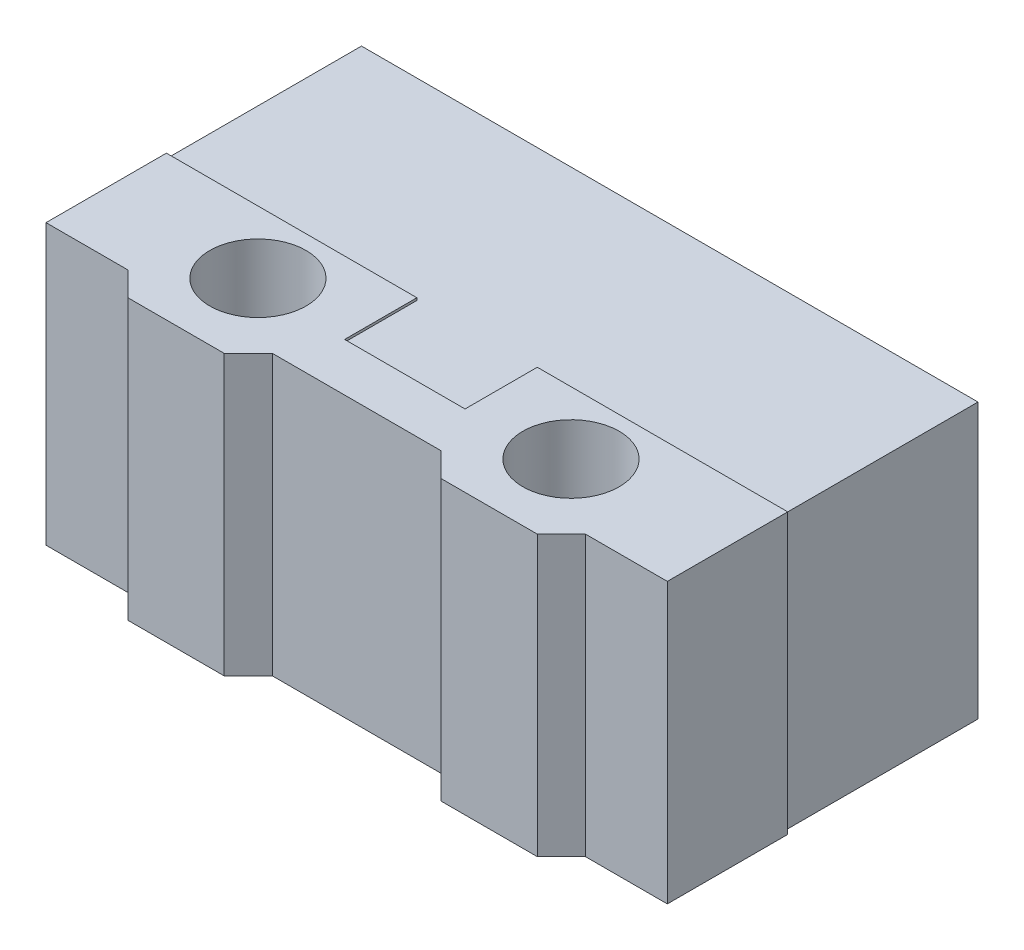
ISO-10303-21;
HEADER;
FILE_DESCRIPTION(('STEP AP214'),'2;1');
FILE_NAME('part.step','',(''),(''),'','','');
FILE_SCHEMA(('AUTOMOTIVE_DESIGN { 1 0 10303 214 1 1 1 1 }'));
ENDSEC;
DATA;
#1=APPLICATION_CONTEXT('core data for automotive mechanical design processes');
#2=APPLICATION_PROTOCOL_DEFINITION('international standard','automotive_design',2000,#1);
#3=PRODUCT_CONTEXT('',#1,'mechanical');
#4=PRODUCT('Part','Part','',(#3));
#5=PRODUCT_RELATED_PRODUCT_CATEGORY('part','',(#4));
#6=PRODUCT_DEFINITION_FORMATION('','',#4);
#7=PRODUCT_DEFINITION_CONTEXT('part definition',#1,'design');
#8=PRODUCT_DEFINITION('design','',#6,#7);
#9=PRODUCT_DEFINITION_SHAPE('','',#8);
#10=(LENGTH_UNIT() NAMED_UNIT(*) SI_UNIT(.MILLI.,.METRE.));
#11=(NAMED_UNIT(*) PLANE_ANGLE_UNIT() SI_UNIT($,.RADIAN.));
#12=(NAMED_UNIT(*) SI_UNIT($,.STERADIAN.) SOLID_ANGLE_UNIT());
#13=UNCERTAINTY_MEASURE_WITH_UNIT(LENGTH_MEASURE(1.E-05),#10,'distance_accuracy_value','');
#14=(GEOMETRIC_REPRESENTATION_CONTEXT(3) GLOBAL_UNCERTAINTY_ASSIGNED_CONTEXT((#13)) GLOBAL_UNIT_ASSIGNED_CONTEXT((#10,
#11,#12)) REPRESENTATION_CONTEXT('',''));
#15=CARTESIAN_POINT('',(0.,0.,0.));
#16=DIRECTION('',(0.,0.,1.));
#17=DIRECTION('',(1.,0.,0.));
#18=AXIS2_PLACEMENT_3D('',#15,#16,#17);
#19=CARTESIAN_POINT('',(0.,-2.9,0.));
#20=DIRECTION('',(0.,1.,0.));
#21=DIRECTION('',(0.,0.,1.));
#22=AXIS2_PLACEMENT_3D('',#19,#20,#21);
#23=PLANE('',#22);
#24=CARTESIAN_POINT('',(-3.25,-2.9,2.05));
#25=DIRECTION('',(0.,-1.,0.));
#26=DIRECTION('',(0.,0.,-1.));
#27=AXIS2_PLACEMENT_3D('',#24,#25,#26);
#28=CIRCLE('',#27,0.999999999999987);
#29=CARTESIAN_POINT('',(-3.25,-2.9,1.05000000000001));
#30=VERTEX_POINT('',#29);
#31=EDGE_CURVE('E789',#30,#30,#28,.T.);
#32=ORIENTED_EDGE('',*,*,#31,.F.);
#33=EDGE_LOOP('',(#32));
#34=FACE_BOUND('',#33,.T.);
#35=DIRECTION('',(-1.,0.,0.));
#36=VECTOR('',#35,1.);
#37=CARTESIAN_POINT('',(-1.69135538907714E-13,-2.9,3.24999999999967));
#38=LINE('',#37,#36);
#39=CARTESIAN_POINT('',(6.45,-2.9,3.25));
#40=VERTEX_POINT('',#39);
#41=CARTESIAN_POINT('',(4.75,-2.9,3.25));
#42=VERTEX_POINT('',#41);
#43=EDGE_CURVE('E329',#40,#42,#38,.T.);
#44=ORIENTED_EDGE('',*,*,#43,.T.);
#45=DIRECTION('',(0.707106781186548,0.,-0.707106781186547));
#46=VECTOR('',#45,1.);
#47=CARTESIAN_POINT('',(4.,-2.9,4.));
#48=LINE('',#47,#46);
#49=CARTESIAN_POINT('',(4.25,-2.9,3.75));
#50=VERTEX_POINT('',#49);
#51=EDGE_CURVE('E357',#50,#42,#48,.T.);
#52=ORIENTED_EDGE('',*,*,#51,.F.);
#53=DIRECTION('',(1.,0.,0.));
#54=VECTOR('',#53,1.);
#55=CARTESIAN_POINT('',(0.,-2.9,3.75));
#56=LINE('',#55,#54);
#57=CARTESIAN_POINT('',(2.25,-2.9,3.75));
#58=VERTEX_POINT('',#57);
#59=EDGE_CURVE('E355',#58,#50,#56,.T.);
#60=ORIENTED_EDGE('',*,*,#59,.F.);
#61=DIRECTION('',(0.707106781186548,0.,0.707106781186548));
#62=VECTOR('',#61,1.);
#63=CARTESIAN_POINT('',(-0.75,-2.9,0.75));
#64=LINE('',#63,#62);
#65=CARTESIAN_POINT('',(1.75,-2.9,3.25));
#66=VERTEX_POINT('',#65);
#67=EDGE_CURVE('E353',#66,#58,#64,.T.);
#68=ORIENTED_EDGE('',*,*,#67,.F.);
#69=DIRECTION('',(1.,0.,0.));
#70=VECTOR('',#69,1.);
#71=CARTESIAN_POINT('',(0.,-2.9,3.25));
#72=LINE('',#71,#70);
#73=CARTESIAN_POINT('',(-1.75,-2.9,3.25));
#74=VERTEX_POINT('',#73);
#75=EDGE_CURVE('E347',#74,#66,#72,.T.);
#76=ORIENTED_EDGE('',*,*,#75,.F.);
#77=DIRECTION('',(0.707106781186548,0.,-0.707106781186547));
#78=VECTOR('',#77,1.);
#79=CARTESIAN_POINT('',(0.750000000000003,-2.9,0.750000000000005));
#80=LINE('',#79,#78);
#81=CARTESIAN_POINT('',(-2.25,-2.9,3.75));
#82=VERTEX_POINT('',#81);
#83=EDGE_CURVE('E351',#82,#74,#80,.T.);
#84=ORIENTED_EDGE('',*,*,#83,.F.);
#85=DIRECTION('',(1.,0.,0.));
#86=VECTOR('',#85,1.);
#87=CARTESIAN_POINT('',(0.,-2.9,3.75));
#88=LINE('',#87,#86);
#89=CARTESIAN_POINT('',(-4.25,-2.9,3.75));
#90=VERTEX_POINT('',#89);
#91=EDGE_CURVE('E349',#90,#82,#88,.T.);
#92=ORIENTED_EDGE('',*,*,#91,.F.);
#93=DIRECTION('',(0.707106781186548,0.,0.707106781186547));
#94=VECTOR('',#93,1.);
#95=CARTESIAN_POINT('',(-3.99999999999999,-2.9,4.));
#96=LINE('',#95,#94);
#97=CARTESIAN_POINT('',(-4.75,-2.9,3.25));
#98=VERTEX_POINT('',#97);
#99=EDGE_CURVE('E346',#98,#90,#96,.T.);
#100=ORIENTED_EDGE('',*,*,#99,.F.);
#101=CARTESIAN_POINT('',(-6.45,-2.9,3.25));
#102=VERTEX_POINT('',#101);
#103=EDGE_CURVE('E344',#102,#98,#72,.T.);
#104=ORIENTED_EDGE('',*,*,#103,.F.);
#105=DIRECTION('',(0.,0.,1.));
#106=VECTOR('',#105,1.);
#107=CARTESIAN_POINT('',(-6.45,-2.9,0.));
#108=LINE('',#107,#106);
#109=CARTESIAN_POINT('',(-6.45,-2.9,0.750000000000001));
#110=VERTEX_POINT('',#109);
#111=EDGE_CURVE('E342',#110,#102,#108,.T.);
#112=ORIENTED_EDGE('',*,*,#111,.F.);
#113=DIRECTION('',(1.,0.,0.));
#114=VECTOR('',#113,1.);
#115=CARTESIAN_POINT('',(0.,-2.9,0.75));
#116=LINE('',#115,#114);
#117=CARTESIAN_POINT('',(-1.25,-2.9,0.75));
#118=VERTEX_POINT('',#117);
#119=EDGE_CURVE('E339',#110,#118,#116,.T.);
#120=ORIENTED_EDGE('',*,*,#119,.T.);
#121=DIRECTION('',(0.,0.,1.));
#122=VECTOR('',#121,1.);
#123=CARTESIAN_POINT('',(-1.25,-2.9,0.));
#124=LINE('',#123,#122);
#125=CARTESIAN_POINT('',(-1.24999999999999,-2.9,2.25));
#126=VERTEX_POINT('',#125);
#127=EDGE_CURVE('E337',#118,#126,#124,.T.);
#128=ORIENTED_EDGE('',*,*,#127,.T.);
#129=DIRECTION('',(1.,0.,0.));
#130=VECTOR('',#129,1.);
#131=CARTESIAN_POINT('',(0.,-2.9,2.25));
#132=LINE('',#131,#130);
#133=CARTESIAN_POINT('',(1.25000000000001,-2.9,2.25));
#134=VERTEX_POINT('',#133);
#135=EDGE_CURVE('E225',#126,#134,#132,.T.);
#136=ORIENTED_EDGE('',*,*,#135,.T.);
#137=DIRECTION('',(0.,0.,-1.));
#138=VECTOR('',#137,1.);
#139=CARTESIAN_POINT('',(1.25,-2.9,0.));
#140=LINE('',#139,#138);
#141=CARTESIAN_POINT('',(1.25,-2.9,0.75));
#142=VERTEX_POINT('',#141);
#143=EDGE_CURVE('E218',#134,#142,#140,.T.);
#144=ORIENTED_EDGE('',*,*,#143,.T.);
#145=DIRECTION('',(1.,0.,0.));
#146=VECTOR('',#145,1.);
#147=CARTESIAN_POINT('',(0.,-2.9,0.749999999999833));
#148=LINE('',#147,#146);
#149=CARTESIAN_POINT('',(6.45,-2.9,0.750000000000001));
#150=VERTEX_POINT('',#149);
#151=EDGE_CURVE('E318',#142,#150,#148,.T.);
#152=ORIENTED_EDGE('',*,*,#151,.T.);
#153=DIRECTION('',(0.,0.,1.));
#154=VECTOR('',#153,1.);
#155=CARTESIAN_POINT('',(6.45,-2.9,0.));
#156=LINE('',#155,#154);
#157=EDGE_CURVE('E325',#150,#40,#156,.T.);
#158=ORIENTED_EDGE('',*,*,#157,.T.);
#159=EDGE_LOOP('',(#44,#52,#60,#68,#76,#84,#92,#100,#104,#112,#120,#128,#136,#144,#152,#158));
#160=FACE_BOUND('',#159,.T.);
#161=CARTESIAN_POINT('',(3.25,-2.9,2.05));
#162=DIRECTION('',(0.,-1.,0.));
#163=DIRECTION('',(0.,0.,-1.));
#164=AXIS2_PLACEMENT_3D('',#161,#162,#163);
#165=CIRCLE('',#164,0.999999999999987);
#166=CARTESIAN_POINT('',(3.25,-2.9,1.05000000000001));
#167=VERTEX_POINT('',#166);
#168=EDGE_CURVE('E761',#167,#167,#165,.T.);
#169=ORIENTED_EDGE('',*,*,#168,.F.);
#170=EDGE_LOOP('',(#169));
#171=FACE_BOUND('',#170,.T.);
#172=ADVANCED_FACE('F41',(#34,#160,#171),#23,.F.);
#173=CARTESIAN_POINT('',(0.,2.9,0.));
#174=DIRECTION('',(0.,1.,0.));
#175=DIRECTION('',(0.,0.,1.));
#176=AXIS2_PLACEMENT_3D('',#173,#174,#175);
#177=PLANE('',#176);
#178=CARTESIAN_POINT('',(-3.25,2.9,2.05));
#179=DIRECTION('',(0.,-1.,0.));
#180=DIRECTION('',(0.,0.,-1.));
#181=AXIS2_PLACEMENT_3D('',#178,#179,#180);
#182=CIRCLE('',#181,0.999999999999998);
#183=CARTESIAN_POINT('',(-3.25,2.9,1.05));
#184=VERTEX_POINT('',#183);
#185=EDGE_CURVE('E765',#184,#184,#182,.T.);
#186=ORIENTED_EDGE('',*,*,#185,.T.);
#187=EDGE_LOOP('',(#186));
#188=FACE_BOUND('',#187,.T.);
#189=DIRECTION('',(-1.,0.,0.));
#190=VECTOR('',#189,1.);
#191=CARTESIAN_POINT('',(-1.69135538907714E-13,2.9,3.24999999999967));
#192=LINE('',#191,#190);
#193=CARTESIAN_POINT('',(6.45,2.9,3.25));
#194=VERTEX_POINT('',#193);
#195=CARTESIAN_POINT('',(4.75,2.9,3.25));
#196=VERTEX_POINT('',#195);
#197=EDGE_CURVE('E359',#194,#196,#192,.T.);
#198=ORIENTED_EDGE('',*,*,#197,.F.);
#199=DIRECTION('',(0.,0.,1.));
#200=VECTOR('',#199,1.);
#201=CARTESIAN_POINT('',(6.45,2.9,0.));
#202=LINE('',#201,#200);
#203=CARTESIAN_POINT('',(6.45,2.9,0.750000000000001));
#204=VERTEX_POINT('',#203);
#205=EDGE_CURVE('E733',#204,#194,#202,.T.);
#206=ORIENTED_EDGE('',*,*,#205,.F.);
#207=DIRECTION('',(1.,0.,0.));
#208=VECTOR('',#207,1.);
#209=CARTESIAN_POINT('',(0.,2.9,0.749999999999833));
#210=LINE('',#209,#208);
#211=CARTESIAN_POINT('',(1.25,2.9,0.75));
#212=VERTEX_POINT('',#211);
#213=EDGE_CURVE('E320',#212,#204,#210,.T.);
#214=ORIENTED_EDGE('',*,*,#213,.F.);
#215=DIRECTION('',(0.,0.,-1.));
#216=VECTOR('',#215,1.);
#217=CARTESIAN_POINT('',(1.25,2.9,0.));
#218=LINE('',#217,#216);
#219=CARTESIAN_POINT('',(1.25000000000001,2.9,2.25));
#220=VERTEX_POINT('',#219);
#221=EDGE_CURVE('E728',#220,#212,#218,.T.);
#222=ORIENTED_EDGE('',*,*,#221,.F.);
#223=DIRECTION('',(1.,0.,0.));
#224=VECTOR('',#223,1.);
#225=CARTESIAN_POINT('',(0.,2.9,2.25));
#226=LINE('',#225,#224);
#227=CARTESIAN_POINT('',(-1.24999999999999,2.9,2.25));
#228=VERTEX_POINT('',#227);
#229=EDGE_CURVE('E735',#228,#220,#226,.T.);
#230=ORIENTED_EDGE('',*,*,#229,.F.);
#231=DIRECTION('',(0.,0.,1.));
#232=VECTOR('',#231,1.);
#233=CARTESIAN_POINT('',(-1.25,2.9,0.));
#234=LINE('',#233,#232);
#235=CARTESIAN_POINT('',(-1.25,2.9,0.75));
#236=VERTEX_POINT('',#235);
#237=EDGE_CURVE('E741',#236,#228,#234,.T.);
#238=ORIENTED_EDGE('',*,*,#237,.F.);
#239=DIRECTION('',(1.,0.,0.));
#240=VECTOR('',#239,1.);
#241=CARTESIAN_POINT('',(0.,2.9,0.75));
#242=LINE('',#241,#240);
#243=CARTESIAN_POINT('',(-6.45,2.9,0.750000000000001));
#244=VERTEX_POINT('',#243);
#245=EDGE_CURVE('E135',#244,#236,#242,.T.);
#246=ORIENTED_EDGE('',*,*,#245,.F.);
#247=DIRECTION('',(0.,0.,1.));
#248=VECTOR('',#247,1.);
#249=CARTESIAN_POINT('',(-6.45,2.9,0.));
#250=LINE('',#249,#248);
#251=CARTESIAN_POINT('',(-6.45,2.9,3.25));
#252=VERTEX_POINT('',#251);
#253=EDGE_CURVE('E392',#244,#252,#250,.T.);
#254=ORIENTED_EDGE('',*,*,#253,.T.);
#255=DIRECTION('',(1.,0.,0.));
#256=VECTOR('',#255,1.);
#257=CARTESIAN_POINT('',(0.,2.9,3.25));
#258=LINE('',#257,#256);
#259=CARTESIAN_POINT('',(-4.75,2.9,3.25));
#260=VERTEX_POINT('',#259);
#261=EDGE_CURVE('E745',#252,#260,#258,.T.);
#262=ORIENTED_EDGE('',*,*,#261,.T.);
#263=DIRECTION('',(0.707106781186548,0.,0.707106781186547));
#264=VECTOR('',#263,1.);
#265=CARTESIAN_POINT('',(-3.99999999999999,2.9,4.));
#266=LINE('',#265,#264);
#267=CARTESIAN_POINT('',(-4.25,2.9,3.75));
#268=VERTEX_POINT('',#267);
#269=EDGE_CURVE('E747',#260,#268,#266,.T.);
#270=ORIENTED_EDGE('',*,*,#269,.T.);
#271=DIRECTION('',(1.,0.,0.));
#272=VECTOR('',#271,1.);
#273=CARTESIAN_POINT('',(0.,2.9,3.75));
#274=LINE('',#273,#272);
#275=CARTESIAN_POINT('',(-2.25,2.9,3.75));
#276=VERTEX_POINT('',#275);
#277=EDGE_CURVE('E750',#268,#276,#274,.T.);
#278=ORIENTED_EDGE('',*,*,#277,.T.);
#279=DIRECTION('',(0.707106781186548,0.,-0.707106781186547));
#280=VECTOR('',#279,1.);
#281=CARTESIAN_POINT('',(0.750000000000003,2.9,0.750000000000005));
#282=LINE('',#281,#280);
#283=CARTESIAN_POINT('',(-1.75,2.9,3.25));
#284=VERTEX_POINT('',#283);
#285=EDGE_CURVE('E752',#276,#284,#282,.T.);
#286=ORIENTED_EDGE('',*,*,#285,.T.);
#287=CARTESIAN_POINT('',(1.75,2.9,3.25));
#288=VERTEX_POINT('',#287);
#289=EDGE_CURVE('E748',#284,#288,#258,.T.);
#290=ORIENTED_EDGE('',*,*,#289,.T.);
#291=DIRECTION('',(0.707106781186548,0.,0.707106781186548));
#292=VECTOR('',#291,1.);
#293=CARTESIAN_POINT('',(-0.75,2.9,0.75));
#294=LINE('',#293,#292);
#295=CARTESIAN_POINT('',(2.25,2.9,3.75));
#296=VERTEX_POINT('',#295);
#297=EDGE_CURVE('E754',#288,#296,#294,.T.);
#298=ORIENTED_EDGE('',*,*,#297,.T.);
#299=DIRECTION('',(1.,0.,0.));
#300=VECTOR('',#299,1.);
#301=CARTESIAN_POINT('',(0.,2.9,3.75));
#302=LINE('',#301,#300);
#303=CARTESIAN_POINT('',(4.25,2.9,3.75));
#304=VERTEX_POINT('',#303);
#305=EDGE_CURVE('E756',#296,#304,#302,.T.);
#306=ORIENTED_EDGE('',*,*,#305,.T.);
#307=DIRECTION('',(0.707106781186548,0.,-0.707106781186547));
#308=VECTOR('',#307,1.);
#309=CARTESIAN_POINT('',(4.,2.9,4.));
#310=LINE('',#309,#308);
#311=EDGE_CURVE('E362',#304,#196,#310,.T.);
#312=ORIENTED_EDGE('',*,*,#311,.T.);
#313=EDGE_LOOP('',(#198,#206,#214,#222,#230,#238,#246,#254,#262,#270,#278,#286,#290,#298,#306,#312));
#314=FACE_BOUND('',#313,.T.);
#315=CARTESIAN_POINT('',(3.25,2.9,2.05));
#316=DIRECTION('',(0.,-1.,0.));
#317=DIRECTION('',(0.,0.,-1.));
#318=AXIS2_PLACEMENT_3D('',#315,#316,#317);
#319=CIRCLE('',#318,0.999999999999998);
#320=CARTESIAN_POINT('',(3.25,2.9,1.05));
#321=VERTEX_POINT('',#320);
#322=EDGE_CURVE('E758',#321,#321,#319,.T.);
#323=ORIENTED_EDGE('',*,*,#322,.T.);
#324=EDGE_LOOP('',(#323));
#325=FACE_BOUND('',#324,.T.);
#326=ADVANCED_FACE('F412',(#188,#314,#325),#177,.T.);
#327=CARTESIAN_POINT('',(6.4,2.85,0.));
#328=DIRECTION('',(1.,0.,0.));
#329=DIRECTION('',(0.,0.,-1.));
#330=AXIS2_PLACEMENT_3D('',#327,#328,#329);
#331=PLANE('',#330);
#332=DIRECTION('',(0.,0.,1.));
#333=VECTOR('',#332,1.);
#334=CARTESIAN_POINT('',(6.4,-2.85,0.));
#335=LINE('',#334,#333);
#336=CARTESIAN_POINT('',(6.4,-2.85,-3.25));
#337=VERTEX_POINT('',#336);
#338=CARTESIAN_POINT('',(6.4,-2.85,0.75));
#339=VERTEX_POINT('',#338);
#340=EDGE_CURVE('E176',#337,#339,#335,.T.);
#341=ORIENTED_EDGE('',*,*,#340,.F.);
#342=DIRECTION('',(0.,-1.,0.));
#343=VECTOR('',#342,1.);
#344=CARTESIAN_POINT('',(6.4,2.85,-3.25));
#345=LINE('',#344,#343);
#346=CARTESIAN_POINT('',(6.4,2.85,-3.25));
#347=VERTEX_POINT('',#346);
#348=EDGE_CURVE('E50',#347,#337,#345,.T.);
#349=ORIENTED_EDGE('',*,*,#348,.F.);
#350=DIRECTION('',(0.,0.,1.));
#351=VECTOR('',#350,1.);
#352=CARTESIAN_POINT('',(6.4,2.85,0.));
#353=LINE('',#352,#351);
#354=CARTESIAN_POINT('',(6.4,2.85,0.75));
#355=VERTEX_POINT('',#354);
#356=EDGE_CURVE('E163',#347,#355,#353,.T.);
#357=ORIENTED_EDGE('',*,*,#356,.T.);
#358=DIRECTION('',(0.,-1.,0.));
#359=VECTOR('',#358,1.);
#360=CARTESIAN_POINT('',(6.4,2.85,0.75));
#361=LINE('',#360,#359);
#362=EDGE_CURVE('E11',#355,#339,#361,.T.);
#363=ORIENTED_EDGE('',*,*,#362,.T.);
#364=EDGE_LOOP('',(#341,#349,#357,#363));
#365=FACE_BOUND('',#364,.T.);
#366=ADVANCED_FACE('F43',(#365),#331,.T.);
#367=CARTESIAN_POINT('',(0.,2.85,-3.25));
#368=DIRECTION('',(0.,0.,-1.));
#369=DIRECTION('',(-1.,0.,0.));
#370=AXIS2_PLACEMENT_3D('',#367,#368,#369);
#371=PLANE('',#370);
#372=DIRECTION('',(1.,0.,0.));
#373=VECTOR('',#372,1.);
#374=CARTESIAN_POINT('',(0.,-2.85,-3.25));
#375=LINE('',#374,#373);
#376=CARTESIAN_POINT('',(-6.4,-2.85,-3.25));
#377=VERTEX_POINT('',#376);
#378=EDGE_CURVE('E179',#377,#337,#375,.T.);
#379=ORIENTED_EDGE('',*,*,#378,.F.);
#380=DIRECTION('',(0.,-1.,0.));
#381=VECTOR('',#380,1.);
#382=CARTESIAN_POINT('',(-6.4,2.85,-3.25));
#383=LINE('',#382,#381);
#384=CARTESIAN_POINT('',(-6.4,2.85,-3.25));
#385=VERTEX_POINT('',#384);
#386=EDGE_CURVE('E191',#385,#377,#383,.T.);
#387=ORIENTED_EDGE('',*,*,#386,.F.);
#388=DIRECTION('',(1.,0.,0.));
#389=VECTOR('',#388,1.);
#390=CARTESIAN_POINT('',(0.,2.85,-3.25));
#391=LINE('',#390,#389);
#392=EDGE_CURVE('E166',#385,#347,#391,.T.);
#393=ORIENTED_EDGE('',*,*,#392,.T.);
#394=ORIENTED_EDGE('',*,*,#348,.T.);
#395=EDGE_LOOP('',(#379,#387,#393,#394));
#396=FACE_BOUND('',#395,.T.);
#397=ADVANCED_FACE('F195',(#396),#371,.T.);
#398=CARTESIAN_POINT('',(-6.4,2.85,0.));
#399=DIRECTION('',(1.,0.,0.));
#400=DIRECTION('',(0.,0.,-1.));
#401=AXIS2_PLACEMENT_3D('',#398,#399,#400);
#402=PLANE('',#401);
#403=DIRECTION('',(0.,0.,1.));
#404=VECTOR('',#403,1.);
#405=CARTESIAN_POINT('',(-6.4,-2.85,0.));
#406=LINE('',#405,#404);
#407=CARTESIAN_POINT('',(-6.4,-2.85,0.75));
#408=VERTEX_POINT('',#407);
#409=EDGE_CURVE('E182',#377,#408,#406,.T.);
#410=ORIENTED_EDGE('',*,*,#409,.T.);
#411=DIRECTION('',(0.,-1.,0.));
#412=VECTOR('',#411,1.);
#413=CARTESIAN_POINT('',(-6.4,2.85,0.75));
#414=LINE('',#413,#412);
#415=CARTESIAN_POINT('',(-6.4,2.85,0.75));
#416=VERTEX_POINT('',#415);
#417=EDGE_CURVE('E171',#416,#408,#414,.T.);
#418=ORIENTED_EDGE('',*,*,#417,.F.);
#419=DIRECTION('',(0.,0.,1.));
#420=VECTOR('',#419,1.);
#421=CARTESIAN_POINT('',(-6.4,2.85,0.));
#422=LINE('',#421,#420);
#423=EDGE_CURVE('E114',#385,#416,#422,.T.);
#424=ORIENTED_EDGE('',*,*,#423,.F.);
#425=ORIENTED_EDGE('',*,*,#386,.T.);
#426=EDGE_LOOP('',(#410,#418,#424,#425));
#427=FACE_BOUND('',#426,.T.);
#428=ADVANCED_FACE('F203',(#427),#402,.F.);
#429=CARTESIAN_POINT('',(0.,2.85,0.));
#430=DIRECTION('',(0.,1.,0.));
#431=DIRECTION('',(0.,0.,1.));
#432=AXIS2_PLACEMENT_3D('',#429,#430,#431);
#433=PLANE('',#432);
#434=DIRECTION('',(0.,0.,-1.));
#435=VECTOR('',#434,1.);
#436=CARTESIAN_POINT('',(1.25,2.85,0.));
#437=LINE('',#436,#435);
#438=CARTESIAN_POINT('',(1.25000000000001,2.85,2.25));
#439=VERTEX_POINT('',#438);
#440=CARTESIAN_POINT('',(1.25,2.85,0.75));
#441=VERTEX_POINT('',#440);
#442=EDGE_CURVE('E92',#439,#441,#437,.T.);
#443=ORIENTED_EDGE('',*,*,#442,.T.);
#444=DIRECTION('',(1.,0.,0.));
#445=VECTOR('',#444,1.);
#446=CARTESIAN_POINT('',(0.,2.85,0.75));
#447=LINE('',#446,#445);
#448=EDGE_CURVE('E161',#441,#355,#447,.T.);
#449=ORIENTED_EDGE('',*,*,#448,.T.);
#450=ORIENTED_EDGE('',*,*,#356,.F.);
#451=ORIENTED_EDGE('',*,*,#392,.F.);
#452=ORIENTED_EDGE('',*,*,#423,.T.);
#453=DIRECTION('',(1.,0.,0.));
#454=VECTOR('',#453,1.);
#455=CARTESIAN_POINT('',(0.,2.85,0.75));
#456=LINE('',#455,#454);
#457=CARTESIAN_POINT('',(-1.25,2.85,0.75));
#458=VERTEX_POINT('',#457);
#459=EDGE_CURVE('E108',#416,#458,#456,.T.);
#460=ORIENTED_EDGE('',*,*,#459,.T.);
#461=DIRECTION('',(0.,0.,1.));
#462=VECTOR('',#461,1.);
#463=CARTESIAN_POINT('',(-1.25,2.85,0.));
#464=LINE('',#463,#462);
#465=CARTESIAN_POINT('',(-1.24999999999999,2.85,2.25));
#466=VERTEX_POINT('',#465);
#467=EDGE_CURVE('E111',#458,#466,#464,.T.);
#468=ORIENTED_EDGE('',*,*,#467,.T.);
#469=DIRECTION('',(1.,0.,0.));
#470=VECTOR('',#469,1.);
#471=CARTESIAN_POINT('',(0.,2.85,2.25));
#472=LINE('',#471,#470);
#473=EDGE_CURVE('E58',#466,#439,#472,.T.);
#474=ORIENTED_EDGE('',*,*,#473,.T.);
#475=EDGE_LOOP('',(#443,#449,#450,#451,#452,#460,#468,#474));
#476=FACE_BOUND('',#475,.T.);
#477=ADVANCED_FACE('F110',(#476),#433,.T.);
#478=CARTESIAN_POINT('',(0.,-2.85,0.));
#479=DIRECTION('',(0.,1.,0.));
#480=DIRECTION('',(0.,0.,1.));
#481=AXIS2_PLACEMENT_3D('',#478,#479,#480);
#482=PLANE('',#481);
#483=DIRECTION('',(0.,0.,-1.));
#484=VECTOR('',#483,1.);
#485=CARTESIAN_POINT('',(1.25,-2.85,0.));
#486=LINE('',#485,#484);
#487=CARTESIAN_POINT('',(1.25000000000001,-2.85,2.25));
#488=VERTEX_POINT('',#487);
#489=CARTESIAN_POINT('',(1.25,-2.85,0.75));
#490=VERTEX_POINT('',#489);
#491=EDGE_CURVE('E88',#488,#490,#486,.T.);
#492=ORIENTED_EDGE('',*,*,#491,.F.);
#493=DIRECTION('',(1.,0.,0.));
#494=VECTOR('',#493,1.);
#495=CARTESIAN_POINT('',(0.,-2.85,2.25));
#496=LINE('',#495,#494);
#497=CARTESIAN_POINT('',(-1.24999999999999,-2.85,2.25));
#498=VERTEX_POINT('',#497);
#499=EDGE_CURVE('E84',#498,#488,#496,.T.);
#500=ORIENTED_EDGE('',*,*,#499,.F.);
#501=DIRECTION('',(0.,0.,1.));
#502=VECTOR('',#501,1.);
#503=CARTESIAN_POINT('',(-1.25,-2.85,0.));
#504=LINE('',#503,#502);
#505=CARTESIAN_POINT('',(-1.25,-2.85,0.75));
#506=VERTEX_POINT('',#505);
#507=EDGE_CURVE('E187',#506,#498,#504,.T.);
#508=ORIENTED_EDGE('',*,*,#507,.F.);
#509=DIRECTION('',(1.,0.,0.));
#510=VECTOR('',#509,1.);
#511=CARTESIAN_POINT('',(0.,-2.85,0.75));
#512=LINE('',#511,#510);
#513=EDGE_CURVE('E184',#408,#506,#512,.T.);
#514=ORIENTED_EDGE('',*,*,#513,.F.);
#515=ORIENTED_EDGE('',*,*,#409,.F.);
#516=ORIENTED_EDGE('',*,*,#378,.T.);
#517=ORIENTED_EDGE('',*,*,#340,.T.);
#518=DIRECTION('',(1.,0.,0.));
#519=VECTOR('',#518,1.);
#520=CARTESIAN_POINT('',(0.,-2.85,0.75));
#521=LINE('',#520,#519);
#522=EDGE_CURVE('E173',#490,#339,#521,.T.);
#523=ORIENTED_EDGE('',*,*,#522,.F.);
#524=EDGE_LOOP('',(#492,#500,#508,#514,#515,#516,#517,#523));
#525=FACE_BOUND('',#524,.T.);
#526=ADVANCED_FACE('F200',(#525),#482,.F.);
#527=CARTESIAN_POINT('',(1.25,2.9,0.));
#528=DIRECTION('',(-1.,0.,0.));
#529=DIRECTION('',(0.,0.,1.));
#530=AXIS2_PLACEMENT_3D('',#527,#528,#529);
#531=PLANE('',#530);
#532=ORIENTED_EDGE('',*,*,#491,.T.);
#533=DIRECTION('',(0.,-1.,0.));
#534=VECTOR('',#533,1.);
#535=CARTESIAN_POINT('',(1.25,2.9,0.75));
#536=LINE('',#535,#534);
#537=EDGE_CURVE('E150',#490,#142,#536,.T.);
#538=ORIENTED_EDGE('',*,*,#537,.T.);
#539=ORIENTED_EDGE('',*,*,#143,.F.);
#540=DIRECTION('',(0.,-1.,0.));
#541=VECTOR('',#540,1.);
#542=CARTESIAN_POINT('',(1.25000000000001,2.9,2.25));
#543=LINE('',#542,#541);
#544=EDGE_CURVE('E146',#488,#134,#543,.T.);
#545=ORIENTED_EDGE('',*,*,#544,.F.);
#546=EDGE_LOOP('',(#532,#538,#539,#545));
#547=FACE_BOUND('',#546,.T.);
#548=ADVANCED_FACE('F212',(#547),#531,.T.);
#549=CARTESIAN_POINT('',(0.,2.9,2.25));
#550=DIRECTION('',(0.,0.,-1.));
#551=DIRECTION('',(-1.,0.,0.));
#552=AXIS2_PLACEMENT_3D('',#549,#550,#551);
#553=PLANE('',#552);
#554=ORIENTED_EDGE('',*,*,#499,.T.);
#555=ORIENTED_EDGE('',*,*,#544,.T.);
#556=ORIENTED_EDGE('',*,*,#135,.F.);
#557=DIRECTION('',(0.,-1.,0.));
#558=VECTOR('',#557,1.);
#559=CARTESIAN_POINT('',(-1.24999999999999,2.9,2.25));
#560=LINE('',#559,#558);
#561=EDGE_CURVE('E136',#498,#126,#560,.T.);
#562=ORIENTED_EDGE('',*,*,#561,.F.);
#563=EDGE_LOOP('',(#554,#555,#556,#562));
#564=FACE_BOUND('',#563,.T.);
#565=ADVANCED_FACE('F222',(#564),#553,.T.);
#566=CARTESIAN_POINT('',(-1.25,2.9,0.));
#567=DIRECTION('',(1.,0.,0.));
#568=DIRECTION('',(0.,0.,-1.));
#569=AXIS2_PLACEMENT_3D('',#566,#567,#568);
#570=PLANE('',#569);
#571=ORIENTED_EDGE('',*,*,#507,.T.);
#572=ORIENTED_EDGE('',*,*,#561,.T.);
#573=ORIENTED_EDGE('',*,*,#127,.F.);
#574=DIRECTION('',(0.,-1.,0.));
#575=VECTOR('',#574,1.);
#576=CARTESIAN_POINT('',(-1.25,2.9,0.75));
#577=LINE('',#576,#575);
#578=EDGE_CURVE('E137',#506,#118,#577,.T.);
#579=ORIENTED_EDGE('',*,*,#578,.F.);
#580=EDGE_LOOP('',(#571,#572,#573,#579));
#581=FACE_BOUND('',#580,.T.);
#582=ADVANCED_FACE('F398',(#581),#570,.T.);
#583=CARTESIAN_POINT('',(-1.69135538907714E-13,2.9,3.24999999999967));
#584=DIRECTION('',(0.,0.,1.));
#585=DIRECTION('',(1.,0.,0.));
#586=AXIS2_PLACEMENT_3D('',#583,#584,#585);
#587=PLANE('',#586);
#588=ORIENTED_EDGE('',*,*,#43,.F.);
#589=DIRECTION('',(0.,-1.,0.));
#590=VECTOR('',#589,1.);
#591=CARTESIAN_POINT('',(6.45,2.9,3.25));
#592=LINE('',#591,#590);
#593=EDGE_CURVE('E157',#194,#40,#592,.T.);
#594=ORIENTED_EDGE('',*,*,#593,.F.);
#595=ORIENTED_EDGE('',*,*,#197,.T.);
#596=DIRECTION('',(0.,-1.,0.));
#597=VECTOR('',#596,1.);
#598=CARTESIAN_POINT('',(4.75,2.9,3.25));
#599=LINE('',#598,#597);
#600=EDGE_CURVE('E268',#196,#42,#599,.T.);
#601=ORIENTED_EDGE('',*,*,#600,.T.);
#602=EDGE_LOOP('',(#588,#594,#595,#601));
#603=FACE_BOUND('',#602,.T.);
#604=ADVANCED_FACE('F400',(#603),#587,.T.);
#605=CARTESIAN_POINT('',(6.45,2.9,0.));
#606=DIRECTION('',(1.,0.,0.));
#607=DIRECTION('',(0.,0.,-1.));
#608=AXIS2_PLACEMENT_3D('',#605,#606,#607);
#609=PLANE('',#608);
#610=ORIENTED_EDGE('',*,*,#157,.F.);
#611=DIRECTION('',(0.,-1.,0.));
#612=VECTOR('',#611,1.);
#613=CARTESIAN_POINT('',(6.45,2.9,0.750000000000001));
#614=LINE('',#613,#612);
#615=EDGE_CURVE('E154',#204,#150,#614,.T.);
#616=ORIENTED_EDGE('',*,*,#615,.F.);
#617=ORIENTED_EDGE('',*,*,#205,.T.);
#618=ORIENTED_EDGE('',*,*,#593,.T.);
#619=EDGE_LOOP('',(#610,#616,#617,#618));
#620=FACE_BOUND('',#619,.T.);
#621=ADVANCED_FACE('F326',(#620),#609,.T.);
#622=CARTESIAN_POINT('',(0.,2.9,0.749999999999833));
#623=DIRECTION('',(0.,0.,-1.));
#624=DIRECTION('',(-1.,0.,0.));
#625=AXIS2_PLACEMENT_3D('',#622,#623,#624);
#626=PLANE('',#625);
#627=ORIENTED_EDGE('',*,*,#362,.F.);
#628=ORIENTED_EDGE('',*,*,#448,.F.);
#629=EDGE_CURVE('E151',#212,#441,#536,.T.);
#630=ORIENTED_EDGE('',*,*,#629,.F.);
#631=ORIENTED_EDGE('',*,*,#213,.T.);
#632=ORIENTED_EDGE('',*,*,#615,.T.);
#633=ORIENTED_EDGE('',*,*,#151,.F.);
#634=ORIENTED_EDGE('',*,*,#537,.F.);
#635=ORIENTED_EDGE('',*,*,#522,.T.);
#636=EDGE_LOOP('',(#627,#628,#630,#631,#632,#633,#634,#635));
#637=FACE_BOUND('',#636,.T.);
#638=ADVANCED_FACE('F205',(#637),#626,.T.);
#639=ORIENTED_EDGE('',*,*,#629,.T.);
#640=ORIENTED_EDGE('',*,*,#442,.F.);
#641=EDGE_CURVE('E147',#220,#439,#543,.T.);
#642=ORIENTED_EDGE('',*,*,#641,.F.);
#643=ORIENTED_EDGE('',*,*,#221,.T.);
#644=EDGE_LOOP('',(#639,#640,#642,#643));
#645=FACE_BOUND('',#644,.T.);
#646=ADVANCED_FACE('F592',(#645),#531,.T.);
#647=ORIENTED_EDGE('',*,*,#641,.T.);
#648=ORIENTED_EDGE('',*,*,#473,.F.);
#649=EDGE_CURVE('E129',#228,#466,#560,.T.);
#650=ORIENTED_EDGE('',*,*,#649,.F.);
#651=ORIENTED_EDGE('',*,*,#229,.T.);
#652=EDGE_LOOP('',(#647,#648,#650,#651));
#653=FACE_BOUND('',#652,.T.);
#654=ADVANCED_FACE('F408',(#653),#553,.T.);
#655=ORIENTED_EDGE('',*,*,#649,.T.);
#656=ORIENTED_EDGE('',*,*,#467,.F.);
#657=EDGE_CURVE('E126',#236,#458,#577,.T.);
#658=ORIENTED_EDGE('',*,*,#657,.F.);
#659=ORIENTED_EDGE('',*,*,#237,.T.);
#660=EDGE_LOOP('',(#655,#656,#658,#659));
#661=FACE_BOUND('',#660,.T.);
#662=ADVANCED_FACE('F123',(#661),#570,.T.);
#663=CARTESIAN_POINT('',(0.,2.9,0.75));
#664=DIRECTION('',(0.,0.,-1.));
#665=DIRECTION('',(-1.,0.,0.));
#666=AXIS2_PLACEMENT_3D('',#663,#664,#665);
#667=PLANE('',#666);
#668=ORIENTED_EDGE('',*,*,#657,.T.);
#669=ORIENTED_EDGE('',*,*,#459,.F.);
#670=ORIENTED_EDGE('',*,*,#417,.T.);
#671=ORIENTED_EDGE('',*,*,#513,.T.);
#672=ORIENTED_EDGE('',*,*,#578,.T.);
#673=ORIENTED_EDGE('',*,*,#119,.F.);
#674=DIRECTION('',(0.,-1.,0.));
#675=VECTOR('',#674,1.);
#676=CARTESIAN_POINT('',(-6.45,2.9,0.750000000000001));
#677=LINE('',#676,#675);
#678=EDGE_CURVE('E142',#244,#110,#677,.T.);
#679=ORIENTED_EDGE('',*,*,#678,.F.);
#680=ORIENTED_EDGE('',*,*,#245,.T.);
#681=EDGE_LOOP('',(#668,#669,#670,#671,#672,#673,#679,#680));
#682=FACE_BOUND('',#681,.T.);
#683=ADVANCED_FACE('F132',(#682),#667,.T.);
#684=CARTESIAN_POINT('',(-6.45,2.9,0.));
#685=DIRECTION('',(1.,0.,0.));
#686=DIRECTION('',(0.,0.,-1.));
#687=AXIS2_PLACEMENT_3D('',#684,#685,#686);
#688=PLANE('',#687);
#689=ORIENTED_EDGE('',*,*,#111,.T.);
#690=DIRECTION('',(0.,-1.,0.));
#691=VECTOR('',#690,1.);
#692=CARTESIAN_POINT('',(-6.45,2.9,3.25));
#693=LINE('',#692,#691);
#694=EDGE_CURVE('E382',#252,#102,#693,.T.);
#695=ORIENTED_EDGE('',*,*,#694,.F.);
#696=ORIENTED_EDGE('',*,*,#253,.F.);
#697=ORIENTED_EDGE('',*,*,#678,.T.);
#698=EDGE_LOOP('',(#689,#695,#696,#697));
#699=FACE_BOUND('',#698,.T.);
#700=ADVANCED_FACE('F391',(#699),#688,.F.);
#701=CARTESIAN_POINT('',(0.,2.9,3.25));
#702=DIRECTION('',(0.,0.,-1.));
#703=DIRECTION('',(-1.,0.,0.));
#704=AXIS2_PLACEMENT_3D('',#701,#702,#703);
#705=PLANE('',#704);
#706=ORIENTED_EDGE('',*,*,#103,.T.);
#707=DIRECTION('',(0.,-1.,0.));
#708=VECTOR('',#707,1.);
#709=CARTESIAN_POINT('',(-4.75,2.9,3.25));
#710=LINE('',#709,#708);
#711=EDGE_CURVE('E380',#260,#98,#710,.T.);
#712=ORIENTED_EDGE('',*,*,#711,.F.);
#713=ORIENTED_EDGE('',*,*,#261,.F.);
#714=ORIENTED_EDGE('',*,*,#694,.T.);
#715=EDGE_LOOP('',(#706,#712,#713,#714));
#716=FACE_BOUND('',#715,.T.);
#717=ADVANCED_FACE('F441',(#716),#705,.F.);
#718=CARTESIAN_POINT('',(-3.99999999999999,2.9,4.));
#719=DIRECTION('',(0.707106781186547,0.,-0.707106781186548));
#720=DIRECTION('',(-0.707106781186548,0.,-0.707106781186547));
#721=AXIS2_PLACEMENT_3D('',#718,#719,#720);
#722=PLANE('',#721);
#723=ORIENTED_EDGE('',*,*,#99,.T.);
#724=DIRECTION('',(0.,-1.,0.));
#725=VECTOR('',#724,1.);
#726=CARTESIAN_POINT('',(-4.25,2.9,3.75));
#727=LINE('',#726,#725);
#728=EDGE_CURVE('E377',#268,#90,#727,.T.);
#729=ORIENTED_EDGE('',*,*,#728,.F.);
#730=ORIENTED_EDGE('',*,*,#269,.F.);
#731=ORIENTED_EDGE('',*,*,#711,.T.);
#732=EDGE_LOOP('',(#723,#729,#730,#731));
#733=FACE_BOUND('',#732,.T.);
#734=ADVANCED_FACE('F448',(#733),#722,.F.);
#735=CARTESIAN_POINT('',(0.,2.9,3.75));
#736=DIRECTION('',(0.,0.,-1.));
#737=DIRECTION('',(-1.,0.,0.));
#738=AXIS2_PLACEMENT_3D('',#735,#736,#737);
#739=PLANE('',#738);
#740=ORIENTED_EDGE('',*,*,#91,.T.);
#741=DIRECTION('',(0.,-1.,0.));
#742=VECTOR('',#741,1.);
#743=CARTESIAN_POINT('',(-2.25,2.9,3.75));
#744=LINE('',#743,#742);
#745=EDGE_CURVE('E374',#276,#82,#744,.T.);
#746=ORIENTED_EDGE('',*,*,#745,.F.);
#747=ORIENTED_EDGE('',*,*,#277,.F.);
#748=ORIENTED_EDGE('',*,*,#728,.T.);
#749=EDGE_LOOP('',(#740,#746,#747,#748));
#750=FACE_BOUND('',#749,.T.);
#751=ADVANCED_FACE('F444',(#750),#739,.F.);
#752=CARTESIAN_POINT('',(0.750000000000003,2.9,0.750000000000005));
#753=DIRECTION('',(-0.707106781186547,0.,-0.707106781186548));
#754=DIRECTION('',(-0.707106781186548,0.,0.707106781186547));
#755=AXIS2_PLACEMENT_3D('',#752,#753,#754);
#756=PLANE('',#755);
#757=ORIENTED_EDGE('',*,*,#83,.T.);
#758=DIRECTION('',(0.,-1.,0.));
#759=VECTOR('',#758,1.);
#760=CARTESIAN_POINT('',(-1.75,2.9,3.25));
#761=LINE('',#760,#759);
#762=EDGE_CURVE('E371',#284,#74,#761,.T.);
#763=ORIENTED_EDGE('',*,*,#762,.F.);
#764=ORIENTED_EDGE('',*,*,#285,.F.);
#765=ORIENTED_EDGE('',*,*,#745,.T.);
#766=EDGE_LOOP('',(#757,#763,#764,#765));
#767=FACE_BOUND('',#766,.T.);
#768=ADVANCED_FACE('F439',(#767),#756,.F.);
#769=ORIENTED_EDGE('',*,*,#75,.T.);
#770=DIRECTION('',(0.,-1.,0.));
#771=VECTOR('',#770,1.);
#772=CARTESIAN_POINT('',(1.75,2.9,3.25));
#773=LINE('',#772,#771);
#774=EDGE_CURVE('E368',#288,#66,#773,.T.);
#775=ORIENTED_EDGE('',*,*,#774,.F.);
#776=ORIENTED_EDGE('',*,*,#289,.F.);
#777=ORIENTED_EDGE('',*,*,#762,.T.);
#778=EDGE_LOOP('',(#769,#775,#776,#777));
#779=FACE_BOUND('',#778,.T.);
#780=ADVANCED_FACE('F435',(#779),#705,.F.);
#781=CARTESIAN_POINT('',(-0.75,2.9,0.75));
#782=DIRECTION('',(0.707106781186547,0.,-0.707106781186547));
#783=DIRECTION('',(-0.707106781186548,0.,-0.707106781186548));
#784=AXIS2_PLACEMENT_3D('',#781,#782,#783);
#785=PLANE('',#784);
#786=ORIENTED_EDGE('',*,*,#67,.T.);
#787=DIRECTION('',(0.,-1.,0.));
#788=VECTOR('',#787,1.);
#789=CARTESIAN_POINT('',(2.25,2.9,3.75));
#790=LINE('',#789,#788);
#791=EDGE_CURVE('E365',#296,#58,#790,.T.);
#792=ORIENTED_EDGE('',*,*,#791,.F.);
#793=ORIENTED_EDGE('',*,*,#297,.F.);
#794=ORIENTED_EDGE('',*,*,#774,.T.);
#795=EDGE_LOOP('',(#786,#792,#793,#794));
#796=FACE_BOUND('',#795,.T.);
#797=ADVANCED_FACE('F431',(#796),#785,.F.);
#798=CARTESIAN_POINT('',(0.,2.9,3.75));
#799=DIRECTION('',(0.,0.,-1.));
#800=DIRECTION('',(-1.,0.,0.));
#801=AXIS2_PLACEMENT_3D('',#798,#799,#800);
#802=PLANE('',#801);
#803=ORIENTED_EDGE('',*,*,#59,.T.);
#804=DIRECTION('',(0.,-1.,0.));
#805=VECTOR('',#804,1.);
#806=CARTESIAN_POINT('',(4.25,2.9,3.75));
#807=LINE('',#806,#805);
#808=EDGE_CURVE('E361',#304,#50,#807,.T.);
#809=ORIENTED_EDGE('',*,*,#808,.F.);
#810=ORIENTED_EDGE('',*,*,#305,.F.);
#811=ORIENTED_EDGE('',*,*,#791,.T.);
#812=EDGE_LOOP('',(#803,#809,#810,#811));
#813=FACE_BOUND('',#812,.T.);
#814=ADVANCED_FACE('F427',(#813),#802,.F.);
#815=CARTESIAN_POINT('',(4.,2.9,4.));
#816=DIRECTION('',(-0.707106781186547,0.,-0.707106781186548));
#817=DIRECTION('',(-0.707106781186548,0.,0.707106781186547));
#818=AXIS2_PLACEMENT_3D('',#815,#816,#817);
#819=PLANE('',#818);
#820=ORIENTED_EDGE('',*,*,#51,.T.);
#821=ORIENTED_EDGE('',*,*,#600,.F.);
#822=ORIENTED_EDGE('',*,*,#311,.F.);
#823=ORIENTED_EDGE('',*,*,#808,.T.);
#824=EDGE_LOOP('',(#820,#821,#822,#823));
#825=FACE_BOUND('',#824,.T.);
#826=ADVANCED_FACE('F423',(#825),#819,.F.);
#827=CARTESIAN_POINT('',(3.25,-2.9,2.05));
#828=DIRECTION('',(0.,-1.,0.));
#829=DIRECTION('',(0.,0.,-1.));
#830=AXIS2_PLACEMENT_3D('',#827,#828,#829);
#831=CYLINDRICAL_SURFACE('',#830,0.999999999999993);
#832=ORIENTED_EDGE('',*,*,#322,.F.);
#833=EDGE_LOOP('',(#832));
#834=FACE_BOUND('',#833,.T.);
#835=ORIENTED_EDGE('',*,*,#168,.T.);
#836=EDGE_LOOP('',(#835));
#837=FACE_BOUND('',#836,.T.);
#838=ADVANCED_FACE('F426',(#834,#837),#831,.F.);
#839=CARTESIAN_POINT('',(-3.25,-2.9,2.05));
#840=DIRECTION('',(0.,-1.,0.));
#841=DIRECTION('',(0.,0.,-1.));
#842=AXIS2_PLACEMENT_3D('',#839,#840,#841);
#843=CYLINDRICAL_SURFACE('',#842,0.999999999999992);
#844=ORIENTED_EDGE('',*,*,#185,.F.);
#845=EDGE_LOOP('',(#844));
#846=FACE_BOUND('',#845,.T.);
#847=ORIENTED_EDGE('',*,*,#31,.T.);
#848=EDGE_LOOP('',(#847));
#849=FACE_BOUND('',#848,.T.);
#850=ADVANCED_FACE('F503',(#846,#849),#843,.F.);
#851=CLOSED_SHELL('',(#172,#326,#366,#397,#428,#477,#526,#548,#565,#582,#604,#621,#638,#646,
#654,#662,#683,#700,#717,#734,#751,#768,#780,#797,#814,#826,#838,#850));
#852=MANIFOLD_SOLID_BREP('B2',#851);
#853=ADVANCED_BREP_SHAPE_REPRESENTATION('',(#18,#852),#14);
#854=SHAPE_DEFINITION_REPRESENTATION(#9,#853);
ENDSEC;
END-ISO-10303-21;
